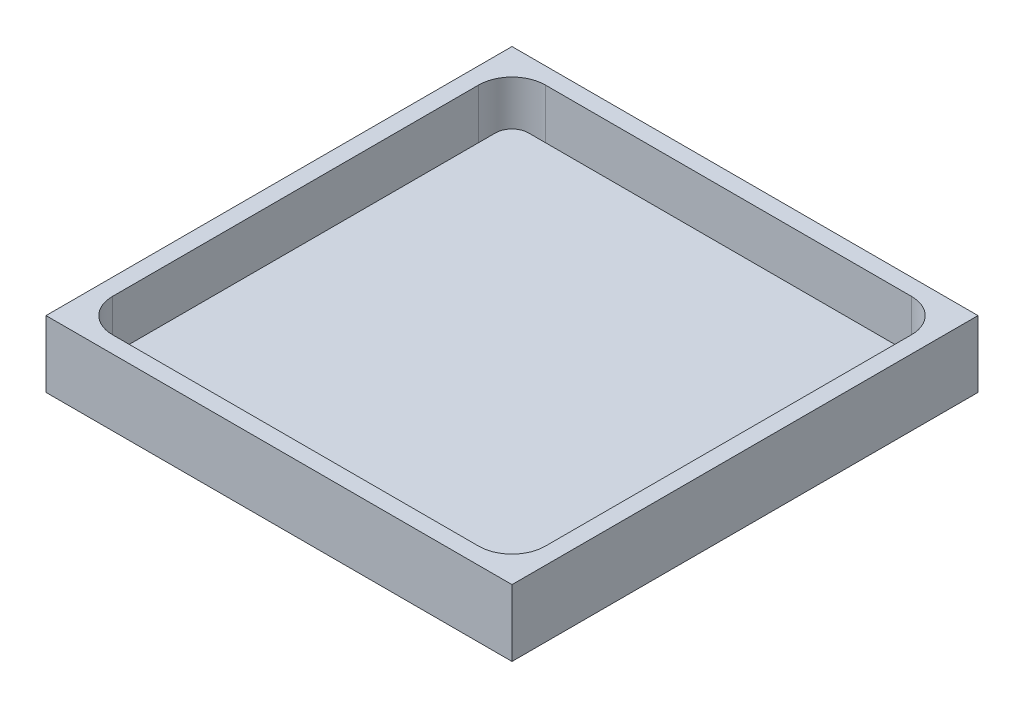
ISO-10303-21;
HEADER;
FILE_DESCRIPTION(('STEP AP214'),'2;1');
FILE_NAME('part.step','',(''),(''),'','','');
FILE_SCHEMA(('AUTOMOTIVE_DESIGN { 1 0 10303 214 1 1 1 1 }'));
ENDSEC;
DATA;
#1=APPLICATION_CONTEXT('core data for automotive mechanical design processes');
#2=APPLICATION_PROTOCOL_DEFINITION('international standard','automotive_design',2000,#1);
#3=PRODUCT_CONTEXT('',#1,'mechanical');
#4=PRODUCT('Part','Part','',(#3));
#5=PRODUCT_RELATED_PRODUCT_CATEGORY('part','',(#4));
#6=PRODUCT_DEFINITION_FORMATION('','',#4);
#7=PRODUCT_DEFINITION_CONTEXT('part definition',#1,'design');
#8=PRODUCT_DEFINITION('design','',#6,#7);
#9=PRODUCT_DEFINITION_SHAPE('','',#8);
#10=(LENGTH_UNIT() NAMED_UNIT(*) SI_UNIT(.MILLI.,.METRE.));
#11=(NAMED_UNIT(*) PLANE_ANGLE_UNIT() SI_UNIT($,.RADIAN.));
#12=(NAMED_UNIT(*) SI_UNIT($,.STERADIAN.) SOLID_ANGLE_UNIT());
#13=UNCERTAINTY_MEASURE_WITH_UNIT(LENGTH_MEASURE(1.E-05),#10,'distance_accuracy_value','');
#14=(GEOMETRIC_REPRESENTATION_CONTEXT(3) GLOBAL_UNCERTAINTY_ASSIGNED_CONTEXT((#13)) GLOBAL_UNIT_ASSIGNED_CONTEXT((#10,
#11,#12)) REPRESENTATION_CONTEXT('',''));
#15=CARTESIAN_POINT('',(0.,0.,0.));
#16=DIRECTION('',(0.,0.,1.));
#17=DIRECTION('',(1.,0.,0.));
#18=AXIS2_PLACEMENT_3D('',#15,#16,#17);
#19=CARTESIAN_POINT('',(0.,1.,0.));
#20=DIRECTION('',(0.,1.,0.));
#21=DIRECTION('',(0.,0.,1.));
#22=AXIS2_PLACEMENT_3D('',#19,#20,#21);
#23=PLANE('',#22);
#24=DIRECTION('',(0.,0.,-1.));
#25=VECTOR('',#24,1.);
#26=CARTESIAN_POINT('',(12.,1.,0.));
#27=LINE('',#26,#25);
#28=CARTESIAN_POINT('',(12.,1.,11.));
#29=VERTEX_POINT('',#28);
#30=CARTESIAN_POINT('',(12.,1.,-11.));
#31=VERTEX_POINT('',#30);
#32=EDGE_CURVE('E220',#29,#31,#27,.T.);
#33=ORIENTED_EDGE('',*,*,#32,.F.);
#34=CARTESIAN_POINT('',(11.,1.,11.));
#35=DIRECTION('',(0.,1.,0.));
#36=DIRECTION('',(0.,0.,1.));
#37=AXIS2_PLACEMENT_3D('',#34,#35,#36);
#38=CIRCLE('',#37,1.);
#39=CARTESIAN_POINT('',(11.,1.,12.));
#40=VERTEX_POINT('',#39);
#41=EDGE_CURVE('E274',#29,#40,#38,.F.);
#42=ORIENTED_EDGE('',*,*,#41,.T.);
#43=DIRECTION('',(1.,0.,0.));
#44=VECTOR('',#43,1.);
#45=CARTESIAN_POINT('',(0.,1.,12.));
#46=LINE('',#45,#44);
#47=CARTESIAN_POINT('',(-11.,1.,12.));
#48=VERTEX_POINT('',#47);
#49=EDGE_CURVE('E223',#48,#40,#46,.T.);
#50=ORIENTED_EDGE('',*,*,#49,.F.);
#51=CARTESIAN_POINT('',(-11.,1.,11.));
#52=DIRECTION('',(0.,1.,0.));
#53=DIRECTION('',(0.,0.,1.));
#54=AXIS2_PLACEMENT_3D('',#51,#52,#53);
#55=CIRCLE('',#54,1.);
#56=CARTESIAN_POINT('',(-12.,1.,11.));
#57=VERTEX_POINT('',#56);
#58=EDGE_CURVE('E278',#48,#57,#55,.F.);
#59=ORIENTED_EDGE('',*,*,#58,.T.);
#60=DIRECTION('',(0.,0.,-1.));
#61=VECTOR('',#60,1.);
#62=CARTESIAN_POINT('',(-12.,1.,0.));
#63=LINE('',#62,#61);
#64=CARTESIAN_POINT('',(-12.,1.,-11.));
#65=VERTEX_POINT('',#64);
#66=EDGE_CURVE('E226',#57,#65,#63,.T.);
#67=ORIENTED_EDGE('',*,*,#66,.T.);
#68=CARTESIAN_POINT('',(-11.,1.,-11.));
#69=DIRECTION('',(0.,1.,0.));
#70=DIRECTION('',(0.,0.,1.));
#71=AXIS2_PLACEMENT_3D('',#68,#69,#70);
#72=CIRCLE('',#71,1.);
#73=CARTESIAN_POINT('',(-11.,1.,-12.));
#74=VERTEX_POINT('',#73);
#75=EDGE_CURVE('E276',#65,#74,#72,.F.);
#76=ORIENTED_EDGE('',*,*,#75,.T.);
#77=DIRECTION('',(1.,0.,0.));
#78=VECTOR('',#77,1.);
#79=CARTESIAN_POINT('',(0.,1.,-12.));
#80=LINE('',#79,#78);
#81=CARTESIAN_POINT('',(11.,1.,-12.));
#82=VERTEX_POINT('',#81);
#83=EDGE_CURVE('E229',#74,#82,#80,.T.);
#84=ORIENTED_EDGE('',*,*,#83,.T.);
#85=CARTESIAN_POINT('',(11.,1.,-11.));
#86=DIRECTION('',(0.,1.,0.));
#87=DIRECTION('',(0.,0.,1.));
#88=AXIS2_PLACEMENT_3D('',#85,#86,#87);
#89=CIRCLE('',#88,1.);
#90=EDGE_CURVE('E272',#82,#31,#89,.F.);
#91=ORIENTED_EDGE('',*,*,#90,.T.);
#92=EDGE_LOOP('',(#33,#42,#50,#59,#67,#76,#84,#91));
#93=FACE_BOUND('',#92,.T.);
#94=DIRECTION('',(1.,0.,0.));
#95=VECTOR('',#94,1.);
#96=CARTESIAN_POINT('',(0.,1.,-13.));
#97=LINE('',#96,#95);
#98=CARTESIAN_POINT('',(-11.,1.,-13.));
#99=VERTEX_POINT('',#98);
#100=CARTESIAN_POINT('',(11.,1.,-13.));
#101=VERTEX_POINT('',#100);
#102=EDGE_CURVE('E238',#99,#101,#97,.T.);
#103=ORIENTED_EDGE('',*,*,#102,.F.);
#104=CARTESIAN_POINT('',(-11.,1.,-11.));
#105=DIRECTION('',(0.,1.,0.));
#106=DIRECTION('',(0.,0.,1.));
#107=AXIS2_PLACEMENT_3D('',#104,#105,#106);
#108=CIRCLE('',#107,2.);
#109=CARTESIAN_POINT('',(-13.,1.,-11.));
#110=VERTEX_POINT('',#109);
#111=EDGE_CURVE('E291',#99,#110,#108,.T.);
#112=ORIENTED_EDGE('',*,*,#111,.T.);
#113=DIRECTION('',(0.,0.,-1.));
#114=VECTOR('',#113,1.);
#115=CARTESIAN_POINT('',(-13.,1.,0.));
#116=LINE('',#115,#114);
#117=CARTESIAN_POINT('',(-13.,1.,11.));
#118=VERTEX_POINT('',#117);
#119=EDGE_CURVE('E241',#118,#110,#116,.T.);
#120=ORIENTED_EDGE('',*,*,#119,.F.);
#121=CARTESIAN_POINT('',(-11.,1.,11.));
#122=DIRECTION('',(0.,1.,0.));
#123=DIRECTION('',(0.,0.,1.));
#124=AXIS2_PLACEMENT_3D('',#121,#122,#123);
#125=CIRCLE('',#124,2.);
#126=CARTESIAN_POINT('',(-11.,1.,13.));
#127=VERTEX_POINT('',#126);
#128=EDGE_CURVE('E285',#118,#127,#125,.T.);
#129=ORIENTED_EDGE('',*,*,#128,.T.);
#130=DIRECTION('',(1.,0.,0.));
#131=VECTOR('',#130,1.);
#132=CARTESIAN_POINT('',(0.,1.,13.));
#133=LINE('',#132,#131);
#134=CARTESIAN_POINT('',(11.,1.,13.));
#135=VERTEX_POINT('',#134);
#136=EDGE_CURVE('E232',#127,#135,#133,.T.);
#137=ORIENTED_EDGE('',*,*,#136,.T.);
#138=CARTESIAN_POINT('',(11.,1.,11.));
#139=DIRECTION('',(0.,1.,0.));
#140=DIRECTION('',(0.,0.,1.));
#141=AXIS2_PLACEMENT_3D('',#138,#139,#140);
#142=CIRCLE('',#141,2.);
#143=CARTESIAN_POINT('',(13.,1.,11.));
#144=VERTEX_POINT('',#143);
#145=EDGE_CURVE('E287',#135,#144,#142,.T.);
#146=ORIENTED_EDGE('',*,*,#145,.T.);
#147=DIRECTION('',(0.,0.,-1.));
#148=VECTOR('',#147,1.);
#149=CARTESIAN_POINT('',(13.,1.,0.));
#150=LINE('',#149,#148);
#151=CARTESIAN_POINT('',(13.,1.,-11.));
#152=VERTEX_POINT('',#151);
#153=EDGE_CURVE('E235',#144,#152,#150,.T.);
#154=ORIENTED_EDGE('',*,*,#153,.T.);
#155=CARTESIAN_POINT('',(11.,1.,-11.));
#156=DIRECTION('',(0.,1.,0.));
#157=DIRECTION('',(0.,0.,1.));
#158=AXIS2_PLACEMENT_3D('',#155,#156,#157);
#159=CIRCLE('',#158,2.);
#160=EDGE_CURVE('E289',#152,#101,#159,.T.);
#161=ORIENTED_EDGE('',*,*,#160,.T.);
#162=EDGE_LOOP('',(#103,#112,#120,#129,#137,#146,#154,#161));
#163=FACE_BOUND('',#162,.T.);
#164=ADVANCED_FACE('F41',(#93,#163),#23,.T.);
#165=CARTESIAN_POINT('',(0.,2.,12.));
#166=DIRECTION('',(0.,0.,-1.));
#167=DIRECTION('',(-1.,0.,0.));
#168=AXIS2_PLACEMENT_3D('',#165,#166,#167);
#169=PLANE('',#168);
#170=ORIENTED_EDGE('',*,*,#49,.T.);
#171=DIRECTION('',(0.,-1.,0.));
#172=VECTOR('',#171,1.);
#173=CARTESIAN_POINT('',(11.,2.,12.));
#174=LINE('',#173,#172);
#175=CARTESIAN_POINT('',(11.,2.,12.));
#176=VERTEX_POINT('',#175);
#177=EDGE_CURVE('E265',#40,#176,#174,.F.);
#178=ORIENTED_EDGE('',*,*,#177,.T.);
#179=DIRECTION('',(1.,0.,0.));
#180=VECTOR('',#179,1.);
#181=CARTESIAN_POINT('',(0.,2.,12.));
#182=LINE('',#181,#180);
#183=CARTESIAN_POINT('',(-11.,2.,12.));
#184=VERTEX_POINT('',#183);
#185=EDGE_CURVE('E203',#184,#176,#182,.T.);
#186=ORIENTED_EDGE('',*,*,#185,.F.);
#187=DIRECTION('',(0.,-1.,0.));
#188=VECTOR('',#187,1.);
#189=CARTESIAN_POINT('',(-11.,1.,12.));
#190=LINE('',#189,#188);
#191=EDGE_CURVE('E262',#184,#48,#190,.T.);
#192=ORIENTED_EDGE('',*,*,#191,.T.);
#193=EDGE_LOOP('',(#170,#178,#186,#192));
#194=FACE_BOUND('',#193,.T.);
#195=ADVANCED_FACE('F355',(#194),#169,.F.);
#196=CARTESIAN_POINT('',(12.,2.,0.));
#197=DIRECTION('',(-1.,0.,0.));
#198=DIRECTION('',(0.,0.,1.));
#199=AXIS2_PLACEMENT_3D('',#196,#197,#198);
#200=PLANE('',#199);
#201=ORIENTED_EDGE('',*,*,#32,.T.);
#202=DIRECTION('',(0.,-1.,0.));
#203=VECTOR('',#202,1.);
#204=CARTESIAN_POINT('',(12.,2.,-11.));
#205=LINE('',#204,#203);
#206=CARTESIAN_POINT('',(12.,2.,-11.));
#207=VERTEX_POINT('',#206);
#208=EDGE_CURVE('E252',#31,#207,#205,.F.);
#209=ORIENTED_EDGE('',*,*,#208,.T.);
#210=DIRECTION('',(0.,0.,-1.));
#211=VECTOR('',#210,1.);
#212=CARTESIAN_POINT('',(12.,2.,0.));
#213=LINE('',#212,#211);
#214=CARTESIAN_POINT('',(12.,2.,11.));
#215=VERTEX_POINT('',#214);
#216=EDGE_CURVE('E206',#215,#207,#213,.T.);
#217=ORIENTED_EDGE('',*,*,#216,.F.);
#218=DIRECTION('',(0.,-1.,0.));
#219=VECTOR('',#218,1.);
#220=CARTESIAN_POINT('',(12.,2.,11.));
#221=LINE('',#220,#219);
#222=EDGE_CURVE('E249',#215,#29,#221,.T.);
#223=ORIENTED_EDGE('',*,*,#222,.T.);
#224=EDGE_LOOP('',(#201,#209,#217,#223));
#225=FACE_BOUND('',#224,.T.);
#226=ADVANCED_FACE('F363',(#225),#200,.F.);
#227=CARTESIAN_POINT('',(0.,2.,-12.));
#228=DIRECTION('',(0.,0.,-1.));
#229=DIRECTION('',(-1.,0.,0.));
#230=AXIS2_PLACEMENT_3D('',#227,#228,#229);
#231=PLANE('',#230);
#232=DIRECTION('',(1.,0.,0.));
#233=VECTOR('',#232,1.);
#234=CARTESIAN_POINT('',(0.,2.,-12.));
#235=LINE('',#234,#233);
#236=CARTESIAN_POINT('',(-11.,2.,-12.));
#237=VERTEX_POINT('',#236);
#238=CARTESIAN_POINT('',(11.,2.,-12.));
#239=VERTEX_POINT('',#238);
#240=EDGE_CURVE('E214',#237,#239,#235,.T.);
#241=ORIENTED_EDGE('',*,*,#240,.T.);
#242=DIRECTION('',(0.,-1.,0.));
#243=VECTOR('',#242,1.);
#244=CARTESIAN_POINT('',(11.,1.,-12.));
#245=LINE('',#244,#243);
#246=EDGE_CURVE('E246',#239,#82,#245,.T.);
#247=ORIENTED_EDGE('',*,*,#246,.T.);
#248=ORIENTED_EDGE('',*,*,#83,.F.);
#249=DIRECTION('',(0.,-1.,0.));
#250=VECTOR('',#249,1.);
#251=CARTESIAN_POINT('',(-11.,2.,-12.));
#252=LINE('',#251,#250);
#253=EDGE_CURVE('E244',#74,#237,#252,.F.);
#254=ORIENTED_EDGE('',*,*,#253,.T.);
#255=EDGE_LOOP('',(#241,#247,#248,#254));
#256=FACE_BOUND('',#255,.T.);
#257=ADVANCED_FACE('F514',(#256),#231,.T.);
#258=CARTESIAN_POINT('',(-12.,2.,0.));
#259=DIRECTION('',(-1.,0.,0.));
#260=DIRECTION('',(0.,0.,1.));
#261=AXIS2_PLACEMENT_3D('',#258,#259,#260);
#262=PLANE('',#261);
#263=DIRECTION('',(0.,0.,-1.));
#264=VECTOR('',#263,1.);
#265=CARTESIAN_POINT('',(-12.,2.,0.));
#266=LINE('',#265,#264);
#267=CARTESIAN_POINT('',(-12.,2.,11.));
#268=VERTEX_POINT('',#267);
#269=CARTESIAN_POINT('',(-12.,2.,-11.));
#270=VERTEX_POINT('',#269);
#271=EDGE_CURVE('E217',#268,#270,#266,.T.);
#272=ORIENTED_EDGE('',*,*,#271,.T.);
#273=DIRECTION('',(0.,-1.,0.));
#274=VECTOR('',#273,1.);
#275=CARTESIAN_POINT('',(-12.,2.,-11.));
#276=LINE('',#275,#274);
#277=EDGE_CURVE('E269',#270,#65,#276,.T.);
#278=ORIENTED_EDGE('',*,*,#277,.T.);
#279=ORIENTED_EDGE('',*,*,#66,.F.);
#280=DIRECTION('',(0.,-1.,0.));
#281=VECTOR('',#280,1.);
#282=CARTESIAN_POINT('',(-12.,2.,11.));
#283=LINE('',#282,#281);
#284=EDGE_CURVE('E267',#57,#268,#283,.F.);
#285=ORIENTED_EDGE('',*,*,#284,.T.);
#286=EDGE_LOOP('',(#272,#278,#279,#285));
#287=FACE_BOUND('',#286,.T.);
#288=ADVANCED_FACE('F505',(#287),#262,.T.);
#289=CARTESIAN_POINT('',(0.,2.,0.));
#290=DIRECTION('',(0.,1.,0.));
#291=DIRECTION('',(0.,0.,1.));
#292=AXIS2_PLACEMENT_3D('',#289,#290,#291);
#293=PLANE('',#292);
#294=ORIENTED_EDGE('',*,*,#216,.T.);
#295=CARTESIAN_POINT('',(11.,2.,-11.));
#296=DIRECTION('',(0.,1.,0.));
#297=DIRECTION('',(0.,0.,1.));
#298=AXIS2_PLACEMENT_3D('',#295,#296,#297);
#299=CIRCLE('',#298,1.);
#300=EDGE_CURVE('E260',#207,#239,#299,.T.);
#301=ORIENTED_EDGE('',*,*,#300,.T.);
#302=ORIENTED_EDGE('',*,*,#240,.F.);
#303=CARTESIAN_POINT('',(-11.,2.,-11.));
#304=DIRECTION('',(0.,1.,0.));
#305=DIRECTION('',(0.,0.,1.));
#306=AXIS2_PLACEMENT_3D('',#303,#304,#305);
#307=CIRCLE('',#306,1.);
#308=EDGE_CURVE('E256',#237,#270,#307,.T.);
#309=ORIENTED_EDGE('',*,*,#308,.T.);
#310=ORIENTED_EDGE('',*,*,#271,.F.);
#311=CARTESIAN_POINT('',(-11.,2.,11.));
#312=DIRECTION('',(0.,1.,0.));
#313=DIRECTION('',(0.,0.,1.));
#314=AXIS2_PLACEMENT_3D('',#311,#312,#313);
#315=CIRCLE('',#314,1.);
#316=EDGE_CURVE('E254',#268,#184,#315,.T.);
#317=ORIENTED_EDGE('',*,*,#316,.T.);
#318=ORIENTED_EDGE('',*,*,#185,.T.);
#319=CARTESIAN_POINT('',(11.,2.,11.));
#320=DIRECTION('',(0.,1.,0.));
#321=DIRECTION('',(0.,0.,1.));
#322=AXIS2_PLACEMENT_3D('',#319,#320,#321);
#323=CIRCLE('',#322,1.);
#324=EDGE_CURVE('E258',#176,#215,#323,.T.);
#325=ORIENTED_EDGE('',*,*,#324,.T.);
#326=EDGE_LOOP('',(#294,#301,#302,#309,#310,#317,#318,#325));
#327=FACE_BOUND('',#326,.T.);
#328=ADVANCED_FACE('F497',(#327),#293,.T.);
#329=CARTESIAN_POINT('',(0.,4.,14.));
#330=DIRECTION('',(0.,0.,-1.));
#331=DIRECTION('',(-1.,0.,0.));
#332=AXIS2_PLACEMENT_3D('',#329,#330,#331);
#333=PLANE('',#332);
#334=DIRECTION('',(1.,0.,0.));
#335=VECTOR('',#334,1.);
#336=CARTESIAN_POINT('',(0.,0.,14.));
#337=LINE('',#336,#335);
#338=CARTESIAN_POINT('',(-14.,0.,14.));
#339=VERTEX_POINT('',#338);
#340=CARTESIAN_POINT('',(14.,0.,14.));
#341=VERTEX_POINT('',#340);
#342=EDGE_CURVE('E202',#339,#341,#337,.T.);
#343=ORIENTED_EDGE('',*,*,#342,.T.);
#344=DIRECTION('',(0.,-1.,0.));
#345=VECTOR('',#344,1.);
#346=CARTESIAN_POINT('',(14.,4.,14.));
#347=LINE('',#346,#345);
#348=CARTESIAN_POINT('',(14.,4.,14.));
#349=VERTEX_POINT('',#348);
#350=EDGE_CURVE('E183',#349,#341,#347,.T.);
#351=ORIENTED_EDGE('',*,*,#350,.F.);
#352=DIRECTION('',(1.,0.,0.));
#353=VECTOR('',#352,1.);
#354=CARTESIAN_POINT('',(0.,4.,14.));
#355=LINE('',#354,#353);
#356=CARTESIAN_POINT('',(-14.,4.,14.));
#357=VERTEX_POINT('',#356);
#358=EDGE_CURVE('E190',#357,#349,#355,.T.);
#359=ORIENTED_EDGE('',*,*,#358,.F.);
#360=DIRECTION('',(0.,-1.,0.));
#361=VECTOR('',#360,1.);
#362=CARTESIAN_POINT('',(-14.,4.,14.));
#363=LINE('',#362,#361);
#364=EDGE_CURVE('E595',#357,#339,#363,.T.);
#365=ORIENTED_EDGE('',*,*,#364,.T.);
#366=EDGE_LOOP('',(#343,#351,#359,#365));
#367=FACE_BOUND('',#366,.T.);
#368=ADVANCED_FACE('F200',(#367),#333,.F.);
#369=CARTESIAN_POINT('',(14.,4.,0.));
#370=DIRECTION('',(-1.,0.,0.));
#371=DIRECTION('',(0.,0.,1.));
#372=AXIS2_PLACEMENT_3D('',#369,#370,#371);
#373=PLANE('',#372);
#374=DIRECTION('',(0.,0.,-1.));
#375=VECTOR('',#374,1.);
#376=CARTESIAN_POINT('',(14.,0.,0.));
#377=LINE('',#376,#375);
#378=CARTESIAN_POINT('',(14.,0.,-14.));
#379=VERTEX_POINT('',#378);
#380=EDGE_CURVE('E589',#341,#379,#377,.T.);
#381=ORIENTED_EDGE('',*,*,#380,.T.);
#382=DIRECTION('',(0.,-1.,0.));
#383=VECTOR('',#382,1.);
#384=CARTESIAN_POINT('',(14.,4.,-14.));
#385=LINE('',#384,#383);
#386=CARTESIAN_POINT('',(14.,4.,-14.));
#387=VERTEX_POINT('',#386);
#388=EDGE_CURVE('E185',#387,#379,#385,.T.);
#389=ORIENTED_EDGE('',*,*,#388,.F.);
#390=DIRECTION('',(0.,0.,-1.));
#391=VECTOR('',#390,1.);
#392=CARTESIAN_POINT('',(14.,4.,0.));
#393=LINE('',#392,#391);
#394=EDGE_CURVE('E178',#349,#387,#393,.T.);
#395=ORIENTED_EDGE('',*,*,#394,.F.);
#396=ORIENTED_EDGE('',*,*,#350,.T.);
#397=EDGE_LOOP('',(#381,#389,#395,#396));
#398=FACE_BOUND('',#397,.T.);
#399=ADVANCED_FACE('F181',(#398),#373,.F.);
#400=CARTESIAN_POINT('',(0.,4.,-14.));
#401=DIRECTION('',(0.,0.,-1.));
#402=DIRECTION('',(-1.,0.,0.));
#403=AXIS2_PLACEMENT_3D('',#400,#401,#402);
#404=PLANE('',#403);
#405=DIRECTION('',(1.,0.,0.));
#406=VECTOR('',#405,1.);
#407=CARTESIAN_POINT('',(0.,0.,-14.));
#408=LINE('',#407,#406);
#409=CARTESIAN_POINT('',(-14.,0.,-14.));
#410=VERTEX_POINT('',#409);
#411=EDGE_CURVE('E587',#410,#379,#408,.T.);
#412=ORIENTED_EDGE('',*,*,#411,.F.);
#413=DIRECTION('',(0.,-1.,0.));
#414=VECTOR('',#413,1.);
#415=CARTESIAN_POINT('',(-14.,4.,-14.));
#416=LINE('',#415,#414);
#417=CARTESIAN_POINT('',(-14.,4.,-14.));
#418=VERTEX_POINT('',#417);
#419=EDGE_CURVE('E208',#418,#410,#416,.T.);
#420=ORIENTED_EDGE('',*,*,#419,.F.);
#421=DIRECTION('',(1.,0.,0.));
#422=VECTOR('',#421,1.);
#423=CARTESIAN_POINT('',(0.,4.,-14.));
#424=LINE('',#423,#422);
#425=EDGE_CURVE('E189',#418,#387,#424,.T.);
#426=ORIENTED_EDGE('',*,*,#425,.T.);
#427=ORIENTED_EDGE('',*,*,#388,.T.);
#428=EDGE_LOOP('',(#412,#420,#426,#427));
#429=FACE_BOUND('',#428,.T.);
#430=ADVANCED_FACE('F474',(#429),#404,.T.);
#431=CARTESIAN_POINT('',(13.,4.,0.));
#432=DIRECTION('',(-1.,0.,0.));
#433=DIRECTION('',(0.,0.,1.));
#434=AXIS2_PLACEMENT_3D('',#431,#432,#433);
#435=PLANE('',#434);
#436=DIRECTION('',(0.,0.,-1.));
#437=VECTOR('',#436,1.);
#438=CARTESIAN_POINT('',(13.,4.,0.));
#439=LINE('',#438,#437);
#440=CARTESIAN_POINT('',(13.,4.,11.));
#441=VERTEX_POINT('',#440);
#442=CARTESIAN_POINT('',(13.,4.,-11.));
#443=VERTEX_POINT('',#442);
#444=EDGE_CURVE('E313',#441,#443,#439,.T.);
#445=ORIENTED_EDGE('',*,*,#444,.T.);
#446=DIRECTION('',(0.,-1.,0.));
#447=VECTOR('',#446,1.);
#448=CARTESIAN_POINT('',(13.,4.,-11.));
#449=LINE('',#448,#447);
#450=EDGE_CURVE('E300',#443,#152,#449,.T.);
#451=ORIENTED_EDGE('',*,*,#450,.T.);
#452=ORIENTED_EDGE('',*,*,#153,.F.);
#453=DIRECTION('',(0.,-1.,0.));
#454=VECTOR('',#453,1.);
#455=CARTESIAN_POINT('',(13.,4.,11.));
#456=LINE('',#455,#454);
#457=EDGE_CURVE('E298',#144,#441,#456,.F.);
#458=ORIENTED_EDGE('',*,*,#457,.T.);
#459=EDGE_LOOP('',(#445,#451,#452,#458));
#460=FACE_BOUND('',#459,.T.);
#461=ADVANCED_FACE('F319',(#460),#435,.T.);
#462=CARTESIAN_POINT('',(0.,4.,13.));
#463=DIRECTION('',(0.,0.,-1.));
#464=DIRECTION('',(-1.,0.,0.));
#465=AXIS2_PLACEMENT_3D('',#462,#463,#464);
#466=PLANE('',#465);
#467=DIRECTION('',(1.,0.,0.));
#468=VECTOR('',#467,1.);
#469=CARTESIAN_POINT('',(0.,4.,13.));
#470=LINE('',#469,#468);
#471=CARTESIAN_POINT('',(-11.,4.,13.));
#472=VERTEX_POINT('',#471);
#473=CARTESIAN_POINT('',(11.,4.,13.));
#474=VERTEX_POINT('',#473);
#475=EDGE_CURVE('E322',#472,#474,#470,.T.);
#476=ORIENTED_EDGE('',*,*,#475,.T.);
#477=DIRECTION('',(0.,-1.,0.));
#478=VECTOR('',#477,1.);
#479=CARTESIAN_POINT('',(11.,1.,13.));
#480=LINE('',#479,#478);
#481=EDGE_CURVE('E304',#474,#135,#480,.T.);
#482=ORIENTED_EDGE('',*,*,#481,.T.);
#483=ORIENTED_EDGE('',*,*,#136,.F.);
#484=DIRECTION('',(0.,-1.,0.));
#485=VECTOR('',#484,1.);
#486=CARTESIAN_POINT('',(-11.,4.,13.));
#487=LINE('',#486,#485);
#488=EDGE_CURVE('E62',#127,#472,#487,.F.);
#489=ORIENTED_EDGE('',*,*,#488,.T.);
#490=EDGE_LOOP('',(#476,#482,#483,#489));
#491=FACE_BOUND('',#490,.T.);
#492=ADVANCED_FACE('F344',(#491),#466,.T.);
#493=CARTESIAN_POINT('',(-13.,4.,0.));
#494=DIRECTION('',(-1.,0.,0.));
#495=DIRECTION('',(0.,0.,1.));
#496=AXIS2_PLACEMENT_3D('',#493,#494,#495);
#497=PLANE('',#496);
#498=ORIENTED_EDGE('',*,*,#119,.T.);
#499=DIRECTION('',(0.,-1.,0.));
#500=VECTOR('',#499,1.);
#501=CARTESIAN_POINT('',(-13.,4.,-11.));
#502=LINE('',#501,#500);
#503=CARTESIAN_POINT('',(-13.,4.,-11.));
#504=VERTEX_POINT('',#503);
#505=EDGE_CURVE('E296',#110,#504,#502,.F.);
#506=ORIENTED_EDGE('',*,*,#505,.T.);
#507=DIRECTION('',(0.,0.,-1.));
#508=VECTOR('',#507,1.);
#509=CARTESIAN_POINT('',(-13.,4.,0.));
#510=LINE('',#509,#508);
#511=CARTESIAN_POINT('',(-13.,4.,11.));
#512=VERTEX_POINT('',#511);
#513=EDGE_CURVE('E341',#512,#504,#510,.T.);
#514=ORIENTED_EDGE('',*,*,#513,.F.);
#515=DIRECTION('',(0.,-1.,0.));
#516=VECTOR('',#515,1.);
#517=CARTESIAN_POINT('',(-13.,4.,11.));
#518=LINE('',#517,#516);
#519=EDGE_CURVE('E293',#512,#118,#518,.T.);
#520=ORIENTED_EDGE('',*,*,#519,.T.);
#521=EDGE_LOOP('',(#498,#506,#514,#520));
#522=FACE_BOUND('',#521,.T.);
#523=ADVANCED_FACE('F337',(#522),#497,.F.);
#524=CARTESIAN_POINT('',(0.,4.,-13.));
#525=DIRECTION('',(0.,0.,-1.));
#526=DIRECTION('',(-1.,0.,0.));
#527=AXIS2_PLACEMENT_3D('',#524,#525,#526);
#528=PLANE('',#527);
#529=DIRECTION('',(1.,0.,0.));
#530=VECTOR('',#529,1.);
#531=CARTESIAN_POINT('',(0.,4.,-13.));
#532=LINE('',#531,#530);
#533=CARTESIAN_POINT('',(-11.,4.,-13.));
#534=VERTEX_POINT('',#533);
#535=CARTESIAN_POINT('',(11.,4.,-13.));
#536=VERTEX_POINT('',#535);
#537=EDGE_CURVE('E198',#534,#536,#532,.T.);
#538=ORIENTED_EDGE('',*,*,#537,.F.);
#539=DIRECTION('',(0.,-1.,0.));
#540=VECTOR('',#539,1.);
#541=CARTESIAN_POINT('',(-11.,1.,-13.));
#542=LINE('',#541,#540);
#543=EDGE_CURVE('E282',#534,#99,#542,.T.);
#544=ORIENTED_EDGE('',*,*,#543,.T.);
#545=ORIENTED_EDGE('',*,*,#102,.T.);
#546=DIRECTION('',(0.,-1.,0.));
#547=VECTOR('',#546,1.);
#548=CARTESIAN_POINT('',(11.,4.,-13.));
#549=LINE('',#548,#547);
#550=EDGE_CURVE('E280',#101,#536,#549,.F.);
#551=ORIENTED_EDGE('',*,*,#550,.T.);
#552=EDGE_LOOP('',(#538,#544,#545,#551));
#553=FACE_BOUND('',#552,.T.);
#554=ADVANCED_FACE('F329',(#553),#528,.F.);
#555=CARTESIAN_POINT('',(-14.,4.,0.));
#556=DIRECTION('',(-1.,0.,0.));
#557=DIRECTION('',(0.,0.,1.));
#558=AXIS2_PLACEMENT_3D('',#555,#556,#557);
#559=PLANE('',#558);
#560=DIRECTION('',(0.,0.,-1.));
#561=VECTOR('',#560,1.);
#562=CARTESIAN_POINT('',(-14.,0.,0.));
#563=LINE('',#562,#561);
#564=EDGE_CURVE('E323',#339,#410,#563,.T.);
#565=ORIENTED_EDGE('',*,*,#564,.F.);
#566=ORIENTED_EDGE('',*,*,#364,.F.);
#567=DIRECTION('',(0.,0.,-1.));
#568=VECTOR('',#567,1.);
#569=CARTESIAN_POINT('',(-14.,4.,0.));
#570=LINE('',#569,#568);
#571=EDGE_CURVE('E196',#357,#418,#570,.T.);
#572=ORIENTED_EDGE('',*,*,#571,.T.);
#573=ORIENTED_EDGE('',*,*,#419,.T.);
#574=EDGE_LOOP('',(#565,#566,#572,#573));
#575=FACE_BOUND('',#574,.T.);
#576=ADVANCED_FACE('F439',(#575),#559,.T.);
#577=CARTESIAN_POINT('',(0.,4.,0.));
#578=DIRECTION('',(0.,1.,0.));
#579=DIRECTION('',(0.,0.,1.));
#580=AXIS2_PLACEMENT_3D('',#577,#578,#579);
#581=PLANE('',#580);
#582=ORIENTED_EDGE('',*,*,#444,.F.);
#583=CARTESIAN_POINT('',(11.,4.,11.));
#584=DIRECTION('',(0.,1.,0.));
#585=DIRECTION('',(0.,0.,1.));
#586=AXIS2_PLACEMENT_3D('',#583,#584,#585);
#587=CIRCLE('',#586,2.);
#588=EDGE_CURVE('E49',#441,#474,#587,.F.);
#589=ORIENTED_EDGE('',*,*,#588,.T.);
#590=ORIENTED_EDGE('',*,*,#475,.F.);
#591=CARTESIAN_POINT('',(-11.,4.,11.));
#592=DIRECTION('',(0.,1.,0.));
#593=DIRECTION('',(0.,0.,1.));
#594=AXIS2_PLACEMENT_3D('',#591,#592,#593);
#595=CIRCLE('',#594,2.);
#596=EDGE_CURVE('E11',#472,#512,#595,.F.);
#597=ORIENTED_EDGE('',*,*,#596,.T.);
#598=ORIENTED_EDGE('',*,*,#513,.T.);
#599=CARTESIAN_POINT('',(-11.,4.,-11.));
#600=DIRECTION('',(0.,1.,0.));
#601=DIRECTION('',(0.,0.,1.));
#602=AXIS2_PLACEMENT_3D('',#599,#600,#601);
#603=CIRCLE('',#602,2.);
#604=EDGE_CURVE('E307',#504,#534,#603,.F.);
#605=ORIENTED_EDGE('',*,*,#604,.T.);
#606=ORIENTED_EDGE('',*,*,#537,.T.);
#607=CARTESIAN_POINT('',(11.,4.,-11.));
#608=DIRECTION('',(0.,1.,0.));
#609=DIRECTION('',(0.,0.,1.));
#610=AXIS2_PLACEMENT_3D('',#607,#608,#609);
#611=CIRCLE('',#610,2.);
#612=EDGE_CURVE('E309',#536,#443,#611,.F.);
#613=ORIENTED_EDGE('',*,*,#612,.T.);
#614=EDGE_LOOP('',(#582,#589,#590,#597,#598,#605,#606,#613));
#615=FACE_BOUND('',#614,.T.);
#616=ORIENTED_EDGE('',*,*,#358,.T.);
#617=ORIENTED_EDGE('',*,*,#394,.T.);
#618=ORIENTED_EDGE('',*,*,#425,.F.);
#619=ORIENTED_EDGE('',*,*,#571,.F.);
#620=EDGE_LOOP('',(#616,#617,#618,#619));
#621=FACE_BOUND('',#620,.T.);
#622=ADVANCED_FACE('F194',(#615,#621),#581,.T.);
#623=CARTESIAN_POINT('',(0.,0.,0.));
#624=DIRECTION('',(0.,1.,0.));
#625=DIRECTION('',(0.,0.,1.));
#626=AXIS2_PLACEMENT_3D('',#623,#624,#625);
#627=PLANE('',#626);
#628=ORIENTED_EDGE('',*,*,#342,.F.);
#629=ORIENTED_EDGE('',*,*,#564,.T.);
#630=ORIENTED_EDGE('',*,*,#411,.T.);
#631=ORIENTED_EDGE('',*,*,#380,.F.);
#632=EDGE_LOOP('',(#628,#629,#630,#631));
#633=FACE_BOUND('',#632,.T.);
#634=ADVANCED_FACE('F369',(#633),#627,.F.);
#635=CARTESIAN_POINT('',(11.,2.,-11.));
#636=DIRECTION('',(0.,1.,0.));
#637=DIRECTION('',(0.,0.,1.));
#638=AXIS2_PLACEMENT_3D('',#635,#636,#637);
#639=CYLINDRICAL_SURFACE('',#638,1.);
#640=ORIENTED_EDGE('',*,*,#300,.F.);
#641=ORIENTED_EDGE('',*,*,#208,.F.);
#642=ORIENTED_EDGE('',*,*,#90,.F.);
#643=ORIENTED_EDGE('',*,*,#246,.F.);
#644=EDGE_LOOP('',(#640,#641,#642,#643));
#645=FACE_BOUND('',#644,.T.);
#646=ADVANCED_FACE('F372',(#645),#639,.T.);
#647=CARTESIAN_POINT('',(11.,2.,11.));
#648=DIRECTION('',(0.,-1.,0.));
#649=DIRECTION('',(0.,0.,-1.));
#650=AXIS2_PLACEMENT_3D('',#647,#648,#649);
#651=CYLINDRICAL_SURFACE('',#650,1.);
#652=ORIENTED_EDGE('',*,*,#324,.F.);
#653=ORIENTED_EDGE('',*,*,#177,.F.);
#654=ORIENTED_EDGE('',*,*,#41,.F.);
#655=ORIENTED_EDGE('',*,*,#222,.F.);
#656=EDGE_LOOP('',(#652,#653,#654,#655));
#657=FACE_BOUND('',#656,.T.);
#658=ADVANCED_FACE('F376',(#657),#651,.T.);
#659=CARTESIAN_POINT('',(-11.,2.,-11.));
#660=DIRECTION('',(0.,-1.,0.));
#661=DIRECTION('',(0.,0.,-1.));
#662=AXIS2_PLACEMENT_3D('',#659,#660,#661);
#663=CYLINDRICAL_SURFACE('',#662,1.);
#664=ORIENTED_EDGE('',*,*,#308,.F.);
#665=ORIENTED_EDGE('',*,*,#253,.F.);
#666=ORIENTED_EDGE('',*,*,#75,.F.);
#667=ORIENTED_EDGE('',*,*,#277,.F.);
#668=EDGE_LOOP('',(#664,#665,#666,#667));
#669=FACE_BOUND('',#668,.T.);
#670=ADVANCED_FACE('F380',(#669),#663,.T.);
#671=CARTESIAN_POINT('',(-11.,2.,11.));
#672=DIRECTION('',(0.,1.,0.));
#673=DIRECTION('',(0.,0.,1.));
#674=AXIS2_PLACEMENT_3D('',#671,#672,#673);
#675=CYLINDRICAL_SURFACE('',#674,1.);
#676=ORIENTED_EDGE('',*,*,#316,.F.);
#677=ORIENTED_EDGE('',*,*,#284,.F.);
#678=ORIENTED_EDGE('',*,*,#58,.F.);
#679=ORIENTED_EDGE('',*,*,#191,.F.);
#680=EDGE_LOOP('',(#676,#677,#678,#679));
#681=FACE_BOUND('',#680,.T.);
#682=ADVANCED_FACE('F384',(#681),#675,.T.);
#683=CARTESIAN_POINT('',(-11.,4.,-11.));
#684=DIRECTION('',(0.,1.,0.));
#685=DIRECTION('',(0.,0.,1.));
#686=AXIS2_PLACEMENT_3D('',#683,#684,#685);
#687=CYLINDRICAL_SURFACE('',#686,2.);
#688=ORIENTED_EDGE('',*,*,#604,.F.);
#689=ORIENTED_EDGE('',*,*,#505,.F.);
#690=ORIENTED_EDGE('',*,*,#111,.F.);
#691=ORIENTED_EDGE('',*,*,#543,.F.);
#692=EDGE_LOOP('',(#688,#689,#690,#691));
#693=FACE_BOUND('',#692,.T.);
#694=ADVANCED_FACE('F333',(#693),#687,.F.);
#695=CARTESIAN_POINT('',(11.,4.,-11.));
#696=DIRECTION('',(0.,-1.,0.));
#697=DIRECTION('',(0.,0.,-1.));
#698=AXIS2_PLACEMENT_3D('',#695,#696,#697);
#699=CYLINDRICAL_SURFACE('',#698,2.);
#700=ORIENTED_EDGE('',*,*,#612,.F.);
#701=ORIENTED_EDGE('',*,*,#550,.F.);
#702=ORIENTED_EDGE('',*,*,#160,.F.);
#703=ORIENTED_EDGE('',*,*,#450,.F.);
#704=EDGE_LOOP('',(#700,#701,#702,#703));
#705=FACE_BOUND('',#704,.T.);
#706=ADVANCED_FACE('F325',(#705),#699,.F.);
#707=CARTESIAN_POINT('',(11.,4.,11.));
#708=DIRECTION('',(0.,1.,0.));
#709=DIRECTION('',(0.,0.,1.));
#710=AXIS2_PLACEMENT_3D('',#707,#708,#709);
#711=CYLINDRICAL_SURFACE('',#710,2.);
#712=ORIENTED_EDGE('',*,*,#588,.F.);
#713=ORIENTED_EDGE('',*,*,#457,.F.);
#714=ORIENTED_EDGE('',*,*,#145,.F.);
#715=ORIENTED_EDGE('',*,*,#481,.F.);
#716=EDGE_LOOP('',(#712,#713,#714,#715));
#717=FACE_BOUND('',#716,.T.);
#718=ADVANCED_FACE('F347',(#717),#711,.F.);
#719=CARTESIAN_POINT('',(-11.,4.,11.));
#720=DIRECTION('',(0.,-1.,0.));
#721=DIRECTION('',(0.,0.,-1.));
#722=AXIS2_PLACEMENT_3D('',#719,#720,#721);
#723=CYLINDRICAL_SURFACE('',#722,2.);
#724=ORIENTED_EDGE('',*,*,#596,.F.);
#725=ORIENTED_EDGE('',*,*,#488,.F.);
#726=ORIENTED_EDGE('',*,*,#128,.F.);
#727=ORIENTED_EDGE('',*,*,#519,.F.);
#728=EDGE_LOOP('',(#724,#725,#726,#727));
#729=FACE_BOUND('',#728,.T.);
#730=ADVANCED_FACE('F43',(#729),#723,.F.);
#731=CLOSED_SHELL('',(#164,#195,#226,#257,#288,#328,#368,#399,#430,#461,#492,#523,#554,#576,
#622,#634,#646,#658,#670,#682,#694,#706,#718,#730));
#732=MANIFOLD_SOLID_BREP('B2',#731);
#733=ADVANCED_BREP_SHAPE_REPRESENTATION('',(#18,#732),#14);
#734=SHAPE_DEFINITION_REPRESENTATION(#9,#733);
ENDSEC;
END-ISO-10303-21;
